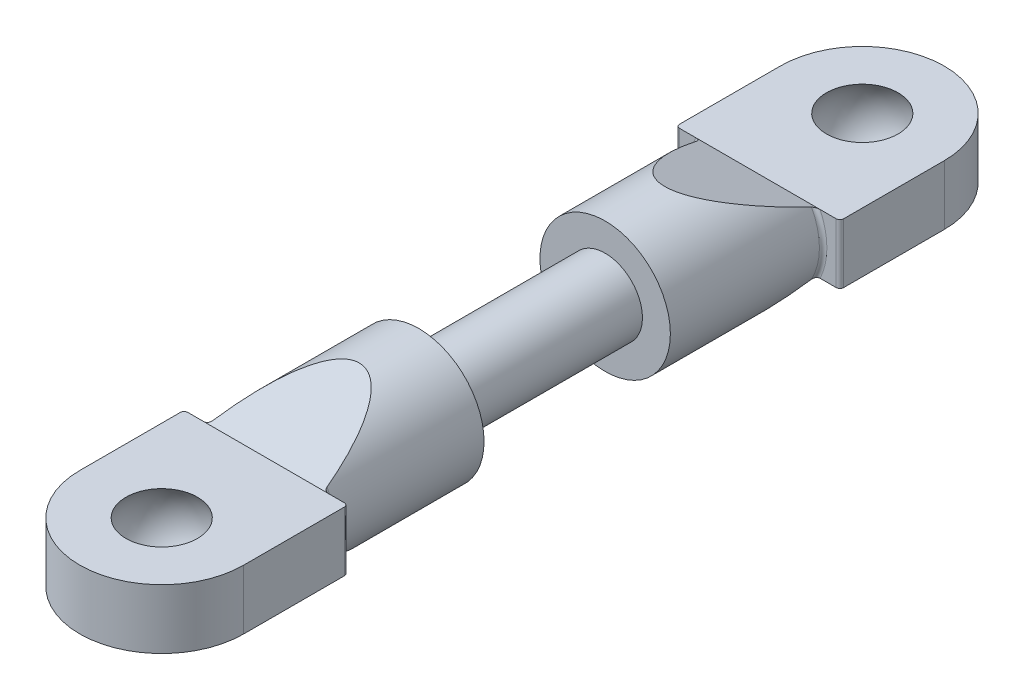
ISO-10303-21;
HEADER;
FILE_DESCRIPTION(('STEP AP214'),'2;1');
FILE_NAME('part.step','',(''),(''),'','','');
FILE_SCHEMA(('AUTOMOTIVE_DESIGN { 1 0 10303 214 1 1 1 1 }'));
ENDSEC;
DATA;
#1=APPLICATION_CONTEXT('core data for automotive mechanical design processes');
#2=APPLICATION_PROTOCOL_DEFINITION('international standard','automotive_design',2000,#1);
#3=PRODUCT_CONTEXT('',#1,'mechanical');
#4=PRODUCT('Part','Part','',(#3));
#5=PRODUCT_RELATED_PRODUCT_CATEGORY('part','',(#4));
#6=PRODUCT_DEFINITION_FORMATION('','',#4);
#7=PRODUCT_DEFINITION_CONTEXT('part definition',#1,'design');
#8=PRODUCT_DEFINITION('design','',#6,#7);
#9=PRODUCT_DEFINITION_SHAPE('','',#8);
#10=(LENGTH_UNIT() NAMED_UNIT(*) SI_UNIT(.MILLI.,.METRE.));
#11=(NAMED_UNIT(*) PLANE_ANGLE_UNIT() SI_UNIT($,.RADIAN.));
#12=(NAMED_UNIT(*) SI_UNIT($,.STERADIAN.) SOLID_ANGLE_UNIT());
#13=UNCERTAINTY_MEASURE_WITH_UNIT(LENGTH_MEASURE(1.E-05),#10,'distance_accuracy_value','');
#14=(GEOMETRIC_REPRESENTATION_CONTEXT(3) GLOBAL_UNCERTAINTY_ASSIGNED_CONTEXT((#13)) GLOBAL_UNIT_ASSIGNED_CONTEXT((#10,
#11,#12)) REPRESENTATION_CONTEXT('',''));
#15=CARTESIAN_POINT('',(0.,0.,0.));
#16=DIRECTION('',(0.,0.,1.));
#17=DIRECTION('',(1.,0.,0.));
#18=AXIS2_PLACEMENT_3D('',#15,#16,#17);
#19=CARTESIAN_POINT('',(0.,0.,-13.2));
#20=DIRECTION('',(0.,0.,1.));
#21=DIRECTION('',(1.,0.,0.));
#22=AXIS2_PLACEMENT_3D('',#19,#20,#21);
#23=CYLINDRICAL_SURFACE('',#22,3.5);
#24=CARTESIAN_POINT('',(0.,0.,-5.));
#25=DIRECTION('',(0.,0.,1.));
#26=DIRECTION('',(1.,0.,0.));
#27=AXIS2_PLACEMENT_3D('',#24,#25,#26);
#28=CIRCLE('',#27,3.5);
#29=CARTESIAN_POINT('',(3.5,0.,-5.));
#30=VERTEX_POINT('',#29);
#31=EDGE_CURVE('E184',#30,#30,#28,.T.);
#32=ORIENTED_EDGE('',*,*,#31,.F.);
#33=EDGE_LOOP('',(#32));
#34=FACE_BOUND('',#33,.T.);
#35=CARTESIAN_POINT('',(0.,0.,-17.4105263157895));
#36=DIRECTION('',(0.,0.934783580588349,-0.355217760623573));
#37=DIRECTION('',(0.,0.355217760623573,0.934783580588349));
#38=AXIS2_PLACEMENT_3D('',#35,#36,#37);
#39=ELLIPSE('',#38,9.8531109307594,3.5);
#40=CARTESIAN_POINT('',(3.07262493643464,1.676,-13.));
#41=VERTEX_POINT('',#40);
#42=CARTESIAN_POINT('',(-3.07262493643464,1.676,-13.));
#43=VERTEX_POINT('',#42);
#44=EDGE_CURVE('E517',#41,#43,#39,.F.);
#45=ORIENTED_EDGE('',*,*,#44,.T.);
#46=CARTESIAN_POINT('',(0.,0.,-13.));
#47=DIRECTION('',(0.,0.,1.));
#48=DIRECTION('',(1.,0.,0.));
#49=AXIS2_PLACEMENT_3D('',#46,#47,#48);
#50=CIRCLE('',#49,3.5);
#51=CARTESIAN_POINT('',(-3.07262493643464,-1.676,-13.));
#52=VERTEX_POINT('',#51);
#53=EDGE_CURVE('E369',#43,#52,#50,.T.);
#54=ORIENTED_EDGE('',*,*,#53,.T.);
#55=CARTESIAN_POINT('',(0.,0.,-17.4105263157895));
#56=DIRECTION('',(0.,-0.934783580588349,-0.355217760623573));
#57=DIRECTION('',(0.,-0.355217760623573,0.934783580588349));
#58=AXIS2_PLACEMENT_3D('',#55,#56,#57);
#59=ELLIPSE('',#58,9.8531109307594,3.5);
#60=CARTESIAN_POINT('',(3.07262493643464,-1.676,-13.));
#61=VERTEX_POINT('',#60);
#62=EDGE_CURVE('E208',#52,#61,#59,.F.);
#63=ORIENTED_EDGE('',*,*,#62,.T.);
#64=CARTESIAN_POINT('',(0.,0.,-13.));
#65=DIRECTION('',(0.,0.,1.));
#66=DIRECTION('',(1.,0.,0.));
#67=AXIS2_PLACEMENT_3D('',#64,#65,#66);
#68=CIRCLE('',#67,3.5);
#69=EDGE_CURVE('E366',#61,#41,#68,.T.);
#70=ORIENTED_EDGE('',*,*,#69,.T.);
#71=EDGE_LOOP('',(#45,#54,#63,#70));
#72=FACE_BOUND('',#71,.T.);
#73=ADVANCED_FACE('F34',(#34,#72),#23,.T.);
#74=CARTESIAN_POINT('',(0.,0.,5.));
#75=DIRECTION('',(0.,0.,-1.));
#76=DIRECTION('',(-1.,0.,0.));
#77=AXIS2_PLACEMENT_3D('',#74,#75,#76);
#78=CYLINDRICAL_SURFACE('',#77,2.);
#79=CARTESIAN_POINT('',(0.,0.,5.));
#80=DIRECTION('',(0.,0.,1.));
#81=DIRECTION('',(1.,0.,0.));
#82=AXIS2_PLACEMENT_3D('',#79,#80,#81);
#83=CIRCLE('',#82,2.);
#84=CARTESIAN_POINT('',(2.,0.,5.));
#85=VERTEX_POINT('',#84);
#86=EDGE_CURVE('E267',#85,#85,#83,.T.);
#87=ORIENTED_EDGE('',*,*,#86,.F.);
#88=EDGE_LOOP('',(#87));
#89=FACE_BOUND('',#88,.T.);
#90=CARTESIAN_POINT('',(0.,0.,-5.));
#91=DIRECTION('',(0.,0.,-1.));
#92=DIRECTION('',(-1.,0.,0.));
#93=AXIS2_PLACEMENT_3D('',#90,#91,#92);
#94=CIRCLE('',#93,2.);
#95=CARTESIAN_POINT('',(-2.,0.,-5.));
#96=VERTEX_POINT('',#95);
#97=EDGE_CURVE('E219',#96,#96,#94,.T.);
#98=ORIENTED_EDGE('',*,*,#97,.F.);
#99=EDGE_LOOP('',(#98));
#100=FACE_BOUND('',#99,.T.);
#101=ADVANCED_FACE('F429',(#89,#100),#78,.T.);
#102=CARTESIAN_POINT('',(0.,0.,13.2));
#103=DIRECTION('',(0.,0.,-1.));
#104=DIRECTION('',(-1.,0.,0.));
#105=AXIS2_PLACEMENT_3D('',#102,#103,#104);
#106=CYLINDRICAL_SURFACE('',#105,3.5);
#107=CARTESIAN_POINT('',(0.,0.,17.4105263157895));
#108=DIRECTION('',(0.,0.934783580588349,-0.355217760623573));
#109=DIRECTION('',(0.,-0.355217760623573,-0.934783580588349));
#110=AXIS2_PLACEMENT_3D('',#107,#108,#109);
#111=ELLIPSE('',#110,9.8531109307594,3.5);
#112=CARTESIAN_POINT('',(3.07262493643464,-1.676,13.));
#113=VERTEX_POINT('',#112);
#114=CARTESIAN_POINT('',(-3.07262493643464,-1.676,13.));
#115=VERTEX_POINT('',#114);
#116=EDGE_CURVE('E231',#113,#115,#111,.T.);
#117=ORIENTED_EDGE('',*,*,#116,.T.);
#118=CARTESIAN_POINT('',(0.,0.,13.));
#119=DIRECTION('',(0.,0.,1.));
#120=DIRECTION('',(1.,0.,0.));
#121=AXIS2_PLACEMENT_3D('',#118,#119,#120);
#122=CIRCLE('',#121,3.5);
#123=CARTESIAN_POINT('',(-3.07262493643464,1.676,13.));
#124=VERTEX_POINT('',#123);
#125=EDGE_CURVE('E288',#115,#124,#122,.F.);
#126=ORIENTED_EDGE('',*,*,#125,.T.);
#127=CARTESIAN_POINT('',(0.,0.,17.4105263157895));
#128=DIRECTION('',(0.,-0.934783580588349,-0.355217760623573));
#129=DIRECTION('',(0.,0.355217760623573,-0.934783580588349));
#130=AXIS2_PLACEMENT_3D('',#127,#128,#129);
#131=ELLIPSE('',#130,9.8531109307594,3.5);
#132=CARTESIAN_POINT('',(3.07262493643464,1.676,13.));
#133=VERTEX_POINT('',#132);
#134=EDGE_CURVE('E228',#124,#133,#131,.T.);
#135=ORIENTED_EDGE('',*,*,#134,.T.);
#136=CARTESIAN_POINT('',(0.,0.,13.));
#137=DIRECTION('',(0.,0.,1.));
#138=DIRECTION('',(1.,0.,0.));
#139=AXIS2_PLACEMENT_3D('',#136,#137,#138);
#140=CIRCLE('',#139,3.5);
#141=EDGE_CURVE('E286',#133,#113,#140,.F.);
#142=ORIENTED_EDGE('',*,*,#141,.T.);
#143=EDGE_LOOP('',(#117,#126,#135,#142));
#144=FACE_BOUND('',#143,.T.);
#145=CARTESIAN_POINT('',(0.,0.,5.));
#146=DIRECTION('',(0.,0.,1.));
#147=DIRECTION('',(1.,0.,0.));
#148=AXIS2_PLACEMENT_3D('',#145,#146,#147);
#149=CIRCLE('',#148,3.5);
#150=CARTESIAN_POINT('',(3.5,0.,5.));
#151=VERTEX_POINT('',#150);
#152=EDGE_CURVE('E264',#151,#151,#149,.T.);
#153=ORIENTED_EDGE('',*,*,#152,.T.);
#154=EDGE_LOOP('',(#153));
#155=FACE_BOUND('',#154,.T.);
#156=ADVANCED_FACE('F490',(#144,#155),#106,.T.);
#157=CARTESIAN_POINT('',(0.,0.,5.));
#158=DIRECTION('',(0.,0.,1.));
#159=DIRECTION('',(1.,0.,0.));
#160=AXIS2_PLACEMENT_3D('',#157,#158,#159);
#161=PLANE('',#160);
#162=ORIENTED_EDGE('',*,*,#86,.T.);
#163=EDGE_LOOP('',(#162));
#164=FACE_BOUND('',#163,.T.);
#165=ORIENTED_EDGE('',*,*,#152,.F.);
#166=EDGE_LOOP('',(#165));
#167=FACE_BOUND('',#166,.T.);
#168=ADVANCED_FACE('F493',(#164,#167),#161,.F.);
#169=CARTESIAN_POINT('',(4.4,1.6,13.2));
#170=DIRECTION('',(0.,0.,1.));
#171=DIRECTION('',(1.,0.,0.));
#172=AXIS2_PLACEMENT_3D('',#169,#170,#171);
#173=PLANE('',#172);
#174=DIRECTION('',(-1.,0.,0.));
#175=VECTOR('',#174,1.);
#176=CARTESIAN_POINT('',(4.4,-1.6,13.2));
#177=LINE('',#176,#175);
#178=CARTESIAN_POINT('',(-3.33616546352245,-1.6,13.2));
#179=VERTEX_POINT('',#178);
#180=CARTESIAN_POINT('',(-4.2,-1.6,13.2));
#181=VERTEX_POINT('',#180);
#182=EDGE_CURVE('E251',#179,#181,#177,.T.);
#183=ORIENTED_EDGE('',*,*,#182,.T.);
#184=DIRECTION('',(0.,-1.,0.));
#185=VECTOR('',#184,1.);
#186=CARTESIAN_POINT('',(-4.2,1.6,13.2));
#187=LINE('',#186,#185);
#188=CARTESIAN_POINT('',(-4.2,1.6,13.2));
#189=VERTEX_POINT('',#188);
#190=EDGE_CURVE('E280',#181,#189,#187,.F.);
#191=ORIENTED_EDGE('',*,*,#190,.T.);
#192=DIRECTION('',(-1.,0.,0.));
#193=VECTOR('',#192,1.);
#194=CARTESIAN_POINT('',(4.4,1.6,13.2));
#195=LINE('',#194,#193);
#196=CARTESIAN_POINT('',(-3.33616546352245,1.6,13.2));
#197=VERTEX_POINT('',#196);
#198=EDGE_CURVE('E238',#197,#189,#195,.T.);
#199=ORIENTED_EDGE('',*,*,#198,.F.);
#200=CARTESIAN_POINT('',(0.,0.,13.2));
#201=DIRECTION('',(0.,0.,1.));
#202=DIRECTION('',(1.,0.,0.));
#203=AXIS2_PLACEMENT_3D('',#200,#201,#202);
#204=CIRCLE('',#203,3.7);
#205=EDGE_CURVE('E277',#197,#179,#204,.T.);
#206=ORIENTED_EDGE('',*,*,#205,.T.);
#207=EDGE_LOOP('',(#183,#191,#199,#206));
#208=FACE_BOUND('',#207,.T.);
#209=ADVANCED_FACE('F458',(#208),#173,.F.);
#210=CARTESIAN_POINT('',(4.2,1.6,13.2));
#211=VERTEX_POINT('',#210);
#212=CARTESIAN_POINT('',(3.33616546352246,1.6,13.2));
#213=VERTEX_POINT('',#212);
#214=EDGE_CURVE('E240',#211,#213,#195,.T.);
#215=ORIENTED_EDGE('',*,*,#214,.F.);
#216=DIRECTION('',(0.,-1.,0.));
#217=VECTOR('',#216,1.);
#218=CARTESIAN_POINT('',(4.2,1.6,13.2));
#219=LINE('',#218,#217);
#220=CARTESIAN_POINT('',(4.2,-1.6,13.2));
#221=VERTEX_POINT('',#220);
#222=EDGE_CURVE('E293',#211,#221,#219,.T.);
#223=ORIENTED_EDGE('',*,*,#222,.T.);
#224=CARTESIAN_POINT('',(3.33616546352246,-1.6,13.2));
#225=VERTEX_POINT('',#224);
#226=EDGE_CURVE('E252',#221,#225,#177,.T.);
#227=ORIENTED_EDGE('',*,*,#226,.T.);
#228=CARTESIAN_POINT('',(0.,0.,13.2));
#229=DIRECTION('',(0.,0.,1.));
#230=DIRECTION('',(1.,0.,0.));
#231=AXIS2_PLACEMENT_3D('',#228,#229,#230);
#232=CIRCLE('',#231,3.7);
#233=EDGE_CURVE('E290',#225,#213,#232,.T.);
#234=ORIENTED_EDGE('',*,*,#233,.T.);
#235=EDGE_LOOP('',(#215,#223,#227,#234));
#236=FACE_BOUND('',#235,.T.);
#237=ADVANCED_FACE('F486',(#236),#173,.F.);
#238=CARTESIAN_POINT('',(4.4,1.6,13.2));
#239=DIRECTION('',(-1.,0.,0.));
#240=DIRECTION('',(0.,0.,1.));
#241=AXIS2_PLACEMENT_3D('',#238,#239,#240);
#242=PLANE('',#241);
#243=DIRECTION('',(0.,0.,-1.));
#244=VECTOR('',#243,1.);
#245=CARTESIAN_POINT('',(4.4,-1.6,13.2));
#246=LINE('',#245,#244);
#247=CARTESIAN_POINT('',(4.4,-1.6,18.8));
#248=VERTEX_POINT('',#247);
#249=CARTESIAN_POINT('',(4.4,-1.6,13.4));
#250=VERTEX_POINT('',#249);
#251=EDGE_CURVE('E234',#248,#250,#246,.T.);
#252=ORIENTED_EDGE('',*,*,#251,.T.);
#253=DIRECTION('',(0.,-1.,0.));
#254=VECTOR('',#253,1.);
#255=CARTESIAN_POINT('',(4.4,1.6,13.4));
#256=LINE('',#255,#254);
#257=CARTESIAN_POINT('',(4.4,1.6,13.4));
#258=VERTEX_POINT('',#257);
#259=EDGE_CURVE('E296',#250,#258,#256,.F.);
#260=ORIENTED_EDGE('',*,*,#259,.T.);
#261=DIRECTION('',(0.,0.,-1.));
#262=VECTOR('',#261,1.);
#263=CARTESIAN_POINT('',(4.4,1.6,13.2));
#264=LINE('',#263,#262);
#265=CARTESIAN_POINT('',(4.4,1.6,18.8));
#266=VERTEX_POINT('',#265);
#267=EDGE_CURVE('E235',#266,#258,#264,.T.);
#268=ORIENTED_EDGE('',*,*,#267,.F.);
#269=DIRECTION('',(0.,-1.,0.));
#270=VECTOR('',#269,1.);
#271=CARTESIAN_POINT('',(4.4,1.6,18.8));
#272=LINE('',#271,#270);
#273=EDGE_CURVE('E248',#266,#248,#272,.T.);
#274=ORIENTED_EDGE('',*,*,#273,.T.);
#275=EDGE_LOOP('',(#252,#260,#268,#274));
#276=FACE_BOUND('',#275,.T.);
#277=ADVANCED_FACE('F480',(#276),#242,.F.);
#278=CARTESIAN_POINT('',(-4.4,1.6,13.2));
#279=DIRECTION('',(1.,0.,0.));
#280=DIRECTION('',(0.,0.,-1.));
#281=AXIS2_PLACEMENT_3D('',#278,#279,#280);
#282=PLANE('',#281);
#283=DIRECTION('',(0.,0.,1.));
#284=VECTOR('',#283,1.);
#285=CARTESIAN_POINT('',(-4.4,1.6,13.2));
#286=LINE('',#285,#284);
#287=CARTESIAN_POINT('',(-4.4,1.6,13.4));
#288=VERTEX_POINT('',#287);
#289=CARTESIAN_POINT('',(-4.4,1.6,18.8));
#290=VERTEX_POINT('',#289);
#291=EDGE_CURVE('E243',#288,#290,#286,.T.);
#292=ORIENTED_EDGE('',*,*,#291,.F.);
#293=DIRECTION('',(0.,-1.,0.));
#294=VECTOR('',#293,1.);
#295=CARTESIAN_POINT('',(-4.4,1.6,13.4));
#296=LINE('',#295,#294);
#297=CARTESIAN_POINT('',(-4.4,-1.6,13.4));
#298=VERTEX_POINT('',#297);
#299=EDGE_CURVE('E270',#288,#298,#296,.T.);
#300=ORIENTED_EDGE('',*,*,#299,.T.);
#301=DIRECTION('',(0.,0.,1.));
#302=VECTOR('',#301,1.);
#303=CARTESIAN_POINT('',(-4.4,-1.6,13.2));
#304=LINE('',#303,#302);
#305=CARTESIAN_POINT('',(-4.4,-1.6,18.8));
#306=VERTEX_POINT('',#305);
#307=EDGE_CURVE('E255',#298,#306,#304,.T.);
#308=ORIENTED_EDGE('',*,*,#307,.T.);
#309=DIRECTION('',(0.,-1.,0.));
#310=VECTOR('',#309,1.);
#311=CARTESIAN_POINT('',(-4.4,1.6,18.8));
#312=LINE('',#311,#310);
#313=EDGE_CURVE('E261',#290,#306,#312,.T.);
#314=ORIENTED_EDGE('',*,*,#313,.F.);
#315=EDGE_LOOP('',(#292,#300,#308,#314));
#316=FACE_BOUND('',#315,.T.);
#317=ADVANCED_FACE('F470',(#316),#282,.F.);
#318=CARTESIAN_POINT('',(0.,1.6,18.8));
#319=DIRECTION('',(0.,-1.,0.));
#320=DIRECTION('',(0.,0.,-1.));
#321=AXIS2_PLACEMENT_3D('',#318,#319,#320);
#322=CYLINDRICAL_SURFACE('',#321,4.4);
#323=CARTESIAN_POINT('',(0.,-1.6,18.8));
#324=DIRECTION('',(0.,1.,0.));
#325=DIRECTION('',(0.,0.,1.));
#326=AXIS2_PLACEMENT_3D('',#323,#324,#325);
#327=CIRCLE('',#326,4.4);
#328=EDGE_CURVE('E239',#306,#248,#327,.T.);
#329=ORIENTED_EDGE('',*,*,#328,.T.);
#330=ORIENTED_EDGE('',*,*,#273,.F.);
#331=CARTESIAN_POINT('',(0.,1.6,18.8));
#332=DIRECTION('',(0.,1.,0.));
#333=DIRECTION('',(0.,0.,1.));
#334=AXIS2_PLACEMENT_3D('',#331,#332,#333);
#335=CIRCLE('',#334,4.4);
#336=EDGE_CURVE('E246',#290,#266,#335,.T.);
#337=ORIENTED_EDGE('',*,*,#336,.F.);
#338=ORIENTED_EDGE('',*,*,#313,.T.);
#339=EDGE_LOOP('',(#329,#330,#337,#338));
#340=FACE_BOUND('',#339,.T.);
#341=ADVANCED_FACE('F476',(#340),#322,.T.);
#342=CARTESIAN_POINT('',(0.,1.6,18.8));
#343=DIRECTION('',(0.,1.,0.));
#344=DIRECTION('',(0.,0.,1.));
#345=AXIS2_PLACEMENT_3D('',#342,#343,#344);
#346=PLANE('',#345);
#347=CARTESIAN_POINT('',(0.,1.6,18.8));
#348=DIRECTION('',(0.,-1.,0.));
#349=DIRECTION('',(0.,0.,-1.));
#350=AXIS2_PLACEMENT_3D('',#347,#348,#349);
#351=CIRCLE('',#350,1.92093727122986);
#352=CARTESIAN_POINT('',(0.,1.6,16.8790627287701));
#353=VERTEX_POINT('',#352);
#354=EDGE_CURVE('E225',#353,#353,#351,.T.);
#355=ORIENTED_EDGE('',*,*,#354,.T.);
#356=EDGE_LOOP('',(#355));
#357=FACE_BOUND('',#356,.T.);
#358=ORIENTED_EDGE('',*,*,#198,.T.);
#359=CARTESIAN_POINT('',(-4.2,1.6,13.4));
#360=DIRECTION('',(0.,1.,0.));
#361=DIRECTION('',(0.,0.,1.));
#362=AXIS2_PLACEMENT_3D('',#359,#360,#361);
#363=CIRCLE('',#362,0.2);
#364=EDGE_CURVE('E284',#189,#288,#363,.T.);
#365=ORIENTED_EDGE('',*,*,#364,.T.);
#366=ORIENTED_EDGE('',*,*,#291,.T.);
#367=ORIENTED_EDGE('',*,*,#336,.T.);
#368=ORIENTED_EDGE('',*,*,#267,.T.);
#369=CARTESIAN_POINT('',(4.2,1.6,13.4));
#370=DIRECTION('',(0.,1.,0.));
#371=DIRECTION('',(0.,0.,1.));
#372=AXIS2_PLACEMENT_3D('',#369,#370,#371);
#373=CIRCLE('',#372,0.2);
#374=EDGE_CURVE('E282',#258,#211,#373,.T.);
#375=ORIENTED_EDGE('',*,*,#374,.T.);
#376=ORIENTED_EDGE('',*,*,#214,.T.);
#377=EDGE_CURVE('E244',#213,#197,#195,.T.);
#378=ORIENTED_EDGE('',*,*,#377,.T.);
#379=EDGE_LOOP('',(#358,#365,#366,#367,#368,#375,#376,#378));
#380=FACE_BOUND('',#379,.T.);
#381=ADVANCED_FACE('F466',(#357,#380),#346,.T.);
#382=CARTESIAN_POINT('',(0.,-1.6,18.8));
#383=DIRECTION('',(0.,1.,0.));
#384=DIRECTION('',(0.,0.,1.));
#385=AXIS2_PLACEMENT_3D('',#382,#383,#384);
#386=PLANE('',#385);
#387=CARTESIAN_POINT('',(0.,-1.6,18.8));
#388=DIRECTION('',(0.,-1.,0.));
#389=DIRECTION('',(0.,0.,-1.));
#390=AXIS2_PLACEMENT_3D('',#387,#388,#389);
#391=CIRCLE('',#390,1.92093727122986);
#392=CARTESIAN_POINT('',(0.,-1.6,16.8790627287701));
#393=VERTEX_POINT('',#392);
#394=EDGE_CURVE('E222',#393,#393,#391,.T.);
#395=ORIENTED_EDGE('',*,*,#394,.F.);
#396=EDGE_LOOP('',(#395));
#397=FACE_BOUND('',#396,.T.);
#398=ORIENTED_EDGE('',*,*,#307,.F.);
#399=CARTESIAN_POINT('',(-4.2,-1.6,13.4));
#400=DIRECTION('',(0.,1.,0.));
#401=DIRECTION('',(0.,0.,1.));
#402=AXIS2_PLACEMENT_3D('',#399,#400,#401);
#403=CIRCLE('',#402,0.2);
#404=EDGE_CURVE('E275',#298,#181,#403,.F.);
#405=ORIENTED_EDGE('',*,*,#404,.T.);
#406=ORIENTED_EDGE('',*,*,#182,.F.);
#407=EDGE_CURVE('E256',#225,#179,#177,.T.);
#408=ORIENTED_EDGE('',*,*,#407,.F.);
#409=ORIENTED_EDGE('',*,*,#226,.F.);
#410=CARTESIAN_POINT('',(4.2,-1.6,13.4));
#411=DIRECTION('',(0.,1.,0.));
#412=DIRECTION('',(0.,0.,1.));
#413=AXIS2_PLACEMENT_3D('',#410,#411,#412);
#414=CIRCLE('',#413,0.2);
#415=EDGE_CURVE('E273',#221,#250,#414,.F.);
#416=ORIENTED_EDGE('',*,*,#415,.T.);
#417=ORIENTED_EDGE('',*,*,#251,.F.);
#418=ORIENTED_EDGE('',*,*,#328,.F.);
#419=EDGE_LOOP('',(#398,#405,#406,#408,#409,#416,#417,#418));
#420=FACE_BOUND('',#419,.T.);
#421=ADVANCED_FACE('F443',(#397,#420),#386,.F.);
#422=CARTESIAN_POINT('',(-4.4,-3.5,8.2));
#423=DIRECTION('',(0.,0.934783580588349,-0.355217760623573));
#424=DIRECTION('',(0.,0.355217760623573,0.934783580588349));
#425=AXIS2_PLACEMENT_3D('',#422,#423,#424);
#426=PLANE('',#425);
#427=ORIENTED_EDGE('',*,*,#116,.F.);
#428=CARTESIAN_POINT('',(3.07262493643464,-1.676,13.));
#429=CARTESIAN_POINT('',(3.07525913325466,-1.67118005301752,13.0126840710065));
#430=CARTESIAN_POINT('',(3.07918235613,-1.66646683438346,13.0250872779383));
#431=CARTESIAN_POINT('',(3.08921423767296,-1.65737029362562,13.0490255430905));
#432=CARTESIAN_POINT('',(3.09531097073757,-1.65298532626488,13.0605649308819));
#433=CARTESIAN_POINT('',(3.10930483827098,-1.64462488245222,13.0825660988099));
#434=CARTESIAN_POINT('',(3.11719446836979,-1.64064779671413,13.0930321139102));
#435=CARTESIAN_POINT('',(3.13452107561461,-1.63313488010904,13.1128029470815));
#436=CARTESIAN_POINT('',(3.14396077179682,-1.62959984420624,13.1221056731415));
#437=CARTESIAN_POINT('',(3.1656427057623,-1.62254518390989,13.1406705686582));
#438=CARTESIAN_POINT('',(3.17809295409183,-1.6191059555853,13.1497211695124));
#439=CARTESIAN_POINT('',(3.20439258761493,-1.61298023516302,13.1658414864131));
#440=CARTESIAN_POINT('',(3.21824243400426,-1.61029399229686,13.1729105465872));
#441=CARTESIAN_POINT('',(3.24583713498838,-1.60596204525645,13.1843104072199));
#442=CARTESIAN_POINT('',(3.25949875334445,-1.60424943623041,13.1888172730779));
#443=CARTESIAN_POINT('',(3.28740504049291,-1.60164388059887,13.195673998424));
#444=CARTESIAN_POINT('',(3.30164782440968,-1.60074847488445,13.1980303292515));
#445=CARTESIAN_POINT('',(3.32270049692924,-1.60010487828012,13.199724004526));
#446=CARTESIAN_POINT('',(3.32943296953685,-1.59999977362747,13.2000005957172));
#447=CARTESIAN_POINT('',(3.33616546352246,-1.6,13.2));
#448=B_SPLINE_CURVE_WITH_KNOTS('',3,(#428,#429,#430,#431,#432,#433,#434,#435,#436,#437,#438,
#439,#440,#441,#442,#443,#444,#445,#446,#447),.UNSPECIFIED.,.F.,.F.,(4,2,2,2,2,2,2,2,2,4),(0.,
0.0413336866130559,0.0824439885943209,0.123385288722125,0.164399188315624,0.211509499743315,
0.258635385904519,0.301924917111099,0.345083748803917,0.365278356525198),.UNSPECIFIED.);
#449=EDGE_CURVE('E344',#113,#225,#448,.T.);
#450=ORIENTED_EDGE('',*,*,#449,.T.);
#451=ORIENTED_EDGE('',*,*,#407,.T.);
#452=CARTESIAN_POINT('',(-3.33616546352245,-1.6,13.2));
#453=CARTESIAN_POINT('',(-3.3217247889496,-1.60000102109849,13.1999973128987));
#454=CARTESIAN_POINT('',(-3.30732735398017,-1.60048239320306,13.1987305442025));
#455=CARTESIAN_POINT('',(-3.27903797361021,-1.60230122827091,13.1939441361292));
#456=CARTESIAN_POINT('',(-3.26514380820992,-1.6036342730108,13.1904361236558));
#457=CARTESIAN_POINT('',(-3.23816996533018,-1.60704814089075,13.1814522608138));
#458=CARTESIAN_POINT('',(-3.22508769183339,-1.60912641944026,13.1759831067361));
#459=CARTESIAN_POINT('',(-3.19990983462446,-1.61395329716965,13.163280796922));
#460=CARTESIAN_POINT('',(-3.18781652178628,-1.61670338430758,13.1560437255064));
#461=CARTESIAN_POINT('',(-3.1634801664601,-1.62317435200966,13.1390148631325));
#462=CARTESIAN_POINT('',(-3.15139976184893,-1.62697283382959,13.1290188583432));
#463=CARTESIAN_POINT('',(-3.12920292694255,-1.63522205983803,13.1073103688473));
#464=CARTESIAN_POINT('',(-3.11908278851064,-1.63967154399486,13.0956012000135));
#465=CARTESIAN_POINT('',(-3.10114453718378,-1.64916662645593,13.0706141409055));
#466=CARTESIAN_POINT('',(-3.09333905758674,-1.65421529294039,13.0573281764727));
#467=CARTESIAN_POINT('',(-3.08062512043024,-1.66478918173404,13.0295021533315));
#468=CARTESIAN_POINT('',(-3.07573640403396,-1.67031736770694,13.0149542955081));
#469=CARTESIAN_POINT('',(-3.07262493643464,-1.676,13.));
#470=B_SPLINE_CURVE_WITH_KNOTS('',3,(#452,#453,#454,#455,#456,#457,#458,#459,#460,#461,#462,
#463,#464,#465,#466,#467,#468,#469),.UNSPECIFIED.,.F.,.F.,(4,2,2,2,2,2,2,2,4),(0.,
0.0431979532669083,0.086173608238872,0.129003899288783,0.171929927242597,0.220106826716467,
0.268191682782834,0.316534347355092,0.365200597381242),.UNSPECIFIED.);
#471=EDGE_CURVE('E298',#179,#115,#470,.T.);
#472=ORIENTED_EDGE('',*,*,#471,.T.);
#473=EDGE_LOOP('',(#427,#450,#451,#472));
#474=FACE_BOUND('',#473,.T.);
#475=ADVANCED_FACE('F313',(#474),#426,.F.);
#476=CARTESIAN_POINT('',(-4.4,3.5,8.2));
#477=DIRECTION('',(0.,-0.934783580588349,-0.355217760623573));
#478=DIRECTION('',(0.,0.355217760623573,-0.934783580588349));
#479=AXIS2_PLACEMENT_3D('',#476,#477,#478);
#480=PLANE('',#479);
#481=ORIENTED_EDGE('',*,*,#134,.F.);
#482=CARTESIAN_POINT('',(-3.07262493643464,1.676,13.));
#483=CARTESIAN_POINT('',(-3.07525913325466,1.67118005301752,13.0126840710065));
#484=CARTESIAN_POINT('',(-3.07918235613,1.66646683438346,13.0250872779383));
#485=CARTESIAN_POINT('',(-3.08921423767296,1.65737029362562,13.0490255430905));
#486=CARTESIAN_POINT('',(-3.09531097073757,1.65298532626488,13.0605649308819));
#487=CARTESIAN_POINT('',(-3.10930483827098,1.64462488245222,13.0825660988099));
#488=CARTESIAN_POINT('',(-3.11719446836979,1.64064779671413,13.0930321139102));
#489=CARTESIAN_POINT('',(-3.13452107561461,1.63313488010904,13.1128029470815));
#490=CARTESIAN_POINT('',(-3.14396077179682,1.62959984420624,13.1221056731415));
#491=CARTESIAN_POINT('',(-3.1656427057623,1.62254518390989,13.1406705686582));
#492=CARTESIAN_POINT('',(-3.17809295409183,1.6191059555853,13.1497211695124));
#493=CARTESIAN_POINT('',(-3.20439258761493,1.61298023516302,13.1658414864131));
#494=CARTESIAN_POINT('',(-3.21824243400426,1.61029399229686,13.1729105465872));
#495=CARTESIAN_POINT('',(-3.24583713498838,1.60596204525645,13.1843104072199));
#496=CARTESIAN_POINT('',(-3.25949875334445,1.60424943623041,13.1888172730779));
#497=CARTESIAN_POINT('',(-3.28740504049291,1.60164388059887,13.195673998424));
#498=CARTESIAN_POINT('',(-3.30164782440968,1.60074847488445,13.1980303292515));
#499=CARTESIAN_POINT('',(-3.32270049692924,1.60010487828012,13.199724004526));
#500=CARTESIAN_POINT('',(-3.32943296953685,1.59999977362747,13.2000005957172));
#501=CARTESIAN_POINT('',(-3.33616546352245,1.6,13.2));
#502=B_SPLINE_CURVE_WITH_KNOTS('',3,(#482,#483,#484,#485,#486,#487,#488,#489,#490,#491,#492,
#493,#494,#495,#496,#497,#498,#499,#500,#501),.UNSPECIFIED.,.F.,.F.,(4,2,2,2,2,2,2,2,2,4),(0.,
0.0413336866130559,0.0824439885943209,0.123385288722125,0.164399188315624,0.211509499743315,
0.258635385904519,0.301924917111099,0.345083748803917,0.365278356525198),.UNSPECIFIED.);
#503=EDGE_CURVE('E306',#124,#197,#502,.T.);
#504=ORIENTED_EDGE('',*,*,#503,.T.);
#505=ORIENTED_EDGE('',*,*,#377,.F.);
#506=CARTESIAN_POINT('',(3.33616546352246,1.6,13.2));
#507=CARTESIAN_POINT('',(3.3217247889496,1.60000102109849,13.1999973128987));
#508=CARTESIAN_POINT('',(3.30732735398017,1.60048239320306,13.1987305442025));
#509=CARTESIAN_POINT('',(3.27903797361021,1.60230122827091,13.1939441361292));
#510=CARTESIAN_POINT('',(3.26514380820992,1.6036342730108,13.1904361236558));
#511=CARTESIAN_POINT('',(3.23816996533018,1.60704814089075,13.1814522608138));
#512=CARTESIAN_POINT('',(3.22508769183339,1.60912641944026,13.1759831067361));
#513=CARTESIAN_POINT('',(3.19990983462446,1.61395329716965,13.163280796922));
#514=CARTESIAN_POINT('',(3.18781652178628,1.61670338430758,13.1560437255064));
#515=CARTESIAN_POINT('',(3.1634801664601,1.62317435200966,13.1390148631325));
#516=CARTESIAN_POINT('',(3.15139976184893,1.62697283382959,13.1290188583432));
#517=CARTESIAN_POINT('',(3.12920292694255,1.63522205983803,13.1073103688473));
#518=CARTESIAN_POINT('',(3.11908278851064,1.63967154399486,13.0956012000135));
#519=CARTESIAN_POINT('',(3.10114453718378,1.64916662645593,13.0706141409055));
#520=CARTESIAN_POINT('',(3.09333905758674,1.65421529294039,13.0573281764727));
#521=CARTESIAN_POINT('',(3.08062512043024,1.66478918173404,13.0295021533315));
#522=CARTESIAN_POINT('',(3.07573640403396,1.67031736770694,13.0149542955081));
#523=CARTESIAN_POINT('',(3.07262493643464,1.676,13.));
#524=B_SPLINE_CURVE_WITH_KNOTS('',3,(#506,#507,#508,#509,#510,#511,#512,#513,#514,#515,#516,
#517,#518,#519,#520,#521,#522,#523),.UNSPECIFIED.,.F.,.F.,(4,2,2,2,2,2,2,2,4),(0.,
0.0431979532669087,0.0861736082388724,0.129003899288783,0.171929927242598,0.220106826716468,
0.268191682782835,0.316534347355092,0.365200597381241),.UNSPECIFIED.);
#525=EDGE_CURVE('E338',#213,#133,#524,.T.);
#526=ORIENTED_EDGE('',*,*,#525,.T.);
#527=EDGE_LOOP('',(#481,#504,#505,#526));
#528=FACE_BOUND('',#527,.T.);
#529=ADVANCED_FACE('F433',(#528),#480,.F.);
#530=CARTESIAN_POINT('',(-4.2,1.6,13.4));
#531=DIRECTION('',(0.,-1.,0.));
#532=DIRECTION('',(0.,0.,-1.));
#533=AXIS2_PLACEMENT_3D('',#530,#531,#532);
#534=CYLINDRICAL_SURFACE('',#533,0.2);
#535=ORIENTED_EDGE('',*,*,#364,.F.);
#536=ORIENTED_EDGE('',*,*,#190,.F.);
#537=ORIENTED_EDGE('',*,*,#404,.F.);
#538=ORIENTED_EDGE('',*,*,#299,.F.);
#539=EDGE_LOOP('',(#535,#536,#537,#538));
#540=FACE_BOUND('',#539,.T.);
#541=ADVANCED_FACE('F322',(#540),#534,.T.);
#542=CARTESIAN_POINT('',(0.,0.,13.));
#543=DIRECTION('',(0.,0.,1.));
#544=DIRECTION('',(1.,0.,0.));
#545=AXIS2_PLACEMENT_3D('',#542,#543,#544);
#546=TOROIDAL_SURFACE('',#545,3.7,0.2);
#547=ORIENTED_EDGE('',*,*,#503,.F.);
#548=ORIENTED_EDGE('',*,*,#125,.F.);
#549=ORIENTED_EDGE('',*,*,#471,.F.);
#550=ORIENTED_EDGE('',*,*,#205,.F.);
#551=EDGE_LOOP('',(#547,#548,#549,#550));
#552=FACE_BOUND('',#551,.T.);
#553=ADVANCED_FACE('F316',(#552),#546,.F.);
#554=CARTESIAN_POINT('',(4.2,1.6,13.4));
#555=DIRECTION('',(0.,-1.,0.));
#556=DIRECTION('',(0.,0.,-1.));
#557=AXIS2_PLACEMENT_3D('',#554,#555,#556);
#558=CYLINDRICAL_SURFACE('',#557,0.2);
#559=ORIENTED_EDGE('',*,*,#374,.F.);
#560=ORIENTED_EDGE('',*,*,#259,.F.);
#561=ORIENTED_EDGE('',*,*,#415,.F.);
#562=ORIENTED_EDGE('',*,*,#222,.F.);
#563=EDGE_LOOP('',(#559,#560,#561,#562));
#564=FACE_BOUND('',#563,.T.);
#565=ADVANCED_FACE('F321',(#564),#558,.T.);
#566=CARTESIAN_POINT('',(0.,0.,13.));
#567=DIRECTION('',(0.,0.,1.));
#568=DIRECTION('',(1.,0.,0.));
#569=AXIS2_PLACEMENT_3D('',#566,#567,#568);
#570=TOROIDAL_SURFACE('',#569,3.7,0.2);
#571=ORIENTED_EDGE('',*,*,#449,.F.);
#572=ORIENTED_EDGE('',*,*,#141,.F.);
#573=ORIENTED_EDGE('',*,*,#525,.F.);
#574=ORIENTED_EDGE('',*,*,#233,.F.);
#575=EDGE_LOOP('',(#571,#572,#573,#574));
#576=FACE_BOUND('',#575,.T.);
#577=ADVANCED_FACE('F328',(#576),#570,.F.);
#578=CARTESIAN_POINT('',(0.,0.,18.8));
#579=DIRECTION('',(0.,-1.,0.));
#580=DIRECTION('',(0.,0.,1.));
#581=AXIS2_PLACEMENT_3D('',#578,#579,#580);
#582=SPHERICAL_SURFACE('',#581,2.5);
#583=ORIENTED_EDGE('',*,*,#394,.T.);
#584=EDGE_LOOP('',(#583));
#585=FACE_BOUND('',#584,.T.);
#586=ORIENTED_EDGE('',*,*,#354,.F.);
#587=EDGE_LOOP('',(#586));
#588=FACE_BOUND('',#587,.T.);
#589=ADVANCED_FACE('F333',(#585,#588),#582,.F.);
#590=CARTESIAN_POINT('',(0.,0.,-5.));
#591=DIRECTION('',(0.,0.,-1.));
#592=DIRECTION('',(1.,0.,0.));
#593=AXIS2_PLACEMENT_3D('',#590,#591,#592);
#594=PLANE('',#593);
#595=ORIENTED_EDGE('',*,*,#97,.T.);
#596=EDGE_LOOP('',(#595));
#597=FACE_BOUND('',#596,.T.);
#598=ORIENTED_EDGE('',*,*,#31,.T.);
#599=EDGE_LOOP('',(#598));
#600=FACE_BOUND('',#599,.T.);
#601=ADVANCED_FACE('F415',(#597,#600),#594,.F.);
#602=CARTESIAN_POINT('',(4.4,1.6,-13.2));
#603=DIRECTION('',(0.,0.,1.));
#604=DIRECTION('',(1.,0.,0.));
#605=AXIS2_PLACEMENT_3D('',#602,#603,#604);
#606=PLANE('',#605);
#607=DIRECTION('',(-1.,0.,0.));
#608=VECTOR('',#607,1.);
#609=CARTESIAN_POINT('',(4.4,1.6,-13.2));
#610=LINE('',#609,#608);
#611=CARTESIAN_POINT('',(-3.33616546352245,1.6,-13.2));
#612=VERTEX_POINT('',#611);
#613=CARTESIAN_POINT('',(-4.2,1.6,-13.2));
#614=VERTEX_POINT('',#613);
#615=EDGE_CURVE('E200',#612,#614,#610,.T.);
#616=ORIENTED_EDGE('',*,*,#615,.T.);
#617=DIRECTION('',(0.,-1.,0.));
#618=VECTOR('',#617,1.);
#619=CARTESIAN_POINT('',(-4.2,1.6,-13.2));
#620=LINE('',#619,#618);
#621=CARTESIAN_POINT('',(-4.2,-1.6,-13.2));
#622=VERTEX_POINT('',#621);
#623=EDGE_CURVE('E354',#614,#622,#620,.T.);
#624=ORIENTED_EDGE('',*,*,#623,.T.);
#625=DIRECTION('',(-1.,0.,0.));
#626=VECTOR('',#625,1.);
#627=CARTESIAN_POINT('',(4.4,-1.6,-13.2));
#628=LINE('',#627,#626);
#629=CARTESIAN_POINT('',(-3.33616546352245,-1.6,-13.2));
#630=VERTEX_POINT('',#629);
#631=EDGE_CURVE('E212',#630,#622,#628,.T.);
#632=ORIENTED_EDGE('',*,*,#631,.F.);
#633=CARTESIAN_POINT('',(0.,0.,-13.2));
#634=DIRECTION('',(0.,0.,1.));
#635=DIRECTION('',(1.,0.,0.));
#636=AXIS2_PLACEMENT_3D('',#633,#634,#635);
#637=CIRCLE('',#636,3.7);
#638=EDGE_CURVE('E351',#630,#612,#637,.F.);
#639=ORIENTED_EDGE('',*,*,#638,.T.);
#640=EDGE_LOOP('',(#616,#624,#632,#639));
#641=FACE_BOUND('',#640,.T.);
#642=ADVANCED_FACE('F411',(#641),#606,.T.);
#643=CARTESIAN_POINT('',(4.2,-1.6,-13.2));
#644=VERTEX_POINT('',#643);
#645=CARTESIAN_POINT('',(3.33616546352246,-1.6,-13.2));
#646=VERTEX_POINT('',#645);
#647=EDGE_CURVE('E193',#644,#646,#628,.T.);
#648=ORIENTED_EDGE('',*,*,#647,.F.);
#649=DIRECTION('',(0.,-1.,0.));
#650=VECTOR('',#649,1.);
#651=CARTESIAN_POINT('',(4.2,1.6,-13.2));
#652=LINE('',#651,#650);
#653=CARTESIAN_POINT('',(4.2,1.6,-13.2));
#654=VERTEX_POINT('',#653);
#655=EDGE_CURVE('E377',#644,#654,#652,.F.);
#656=ORIENTED_EDGE('',*,*,#655,.T.);
#657=CARTESIAN_POINT('',(3.33616546352246,1.6,-13.2));
#658=VERTEX_POINT('',#657);
#659=EDGE_CURVE('E204',#654,#658,#610,.T.);
#660=ORIENTED_EDGE('',*,*,#659,.T.);
#661=CARTESIAN_POINT('',(0.,0.,-13.2));
#662=DIRECTION('',(0.,0.,1.));
#663=DIRECTION('',(1.,0.,0.));
#664=AXIS2_PLACEMENT_3D('',#661,#662,#663);
#665=CIRCLE('',#664,3.7);
#666=EDGE_CURVE('E374',#658,#646,#665,.F.);
#667=ORIENTED_EDGE('',*,*,#666,.T.);
#668=EDGE_LOOP('',(#648,#656,#660,#667));
#669=FACE_BOUND('',#668,.T.);
#670=ADVANCED_FACE('F414',(#669),#606,.T.);
#671=CARTESIAN_POINT('',(4.4,1.6,-13.2));
#672=DIRECTION('',(1.,0.,0.));
#673=DIRECTION('',(0.,0.,-1.));
#674=AXIS2_PLACEMENT_3D('',#671,#672,#673);
#675=PLANE('',#674);
#676=DIRECTION('',(0.,0.,1.));
#677=VECTOR('',#676,1.);
#678=CARTESIAN_POINT('',(4.4,1.6,-13.2));
#679=LINE('',#678,#677);
#680=CARTESIAN_POINT('',(4.4,1.6,-18.8));
#681=VERTEX_POINT('',#680);
#682=CARTESIAN_POINT('',(4.4,1.6,-13.4));
#683=VERTEX_POINT('',#682);
#684=EDGE_CURVE('E176',#681,#683,#679,.T.);
#685=ORIENTED_EDGE('',*,*,#684,.T.);
#686=DIRECTION('',(0.,-1.,0.));
#687=VECTOR('',#686,1.);
#688=CARTESIAN_POINT('',(4.4,1.6,-13.4));
#689=LINE('',#688,#687);
#690=CARTESIAN_POINT('',(4.4,-1.6,-13.4));
#691=VERTEX_POINT('',#690);
#692=EDGE_CURVE('E372',#683,#691,#689,.T.);
#693=ORIENTED_EDGE('',*,*,#692,.T.);
#694=DIRECTION('',(0.,0.,1.));
#695=VECTOR('',#694,1.);
#696=CARTESIAN_POINT('',(4.4,-1.6,-13.2));
#697=LINE('',#696,#695);
#698=CARTESIAN_POINT('',(4.4,-1.6,-18.8));
#699=VERTEX_POINT('',#698);
#700=EDGE_CURVE('E179',#699,#691,#697,.T.);
#701=ORIENTED_EDGE('',*,*,#700,.F.);
#702=DIRECTION('',(0.,-1.,0.));
#703=VECTOR('',#702,1.);
#704=CARTESIAN_POINT('',(4.4,1.6,-18.8));
#705=LINE('',#704,#703);
#706=EDGE_CURVE('E172',#681,#699,#705,.T.);
#707=ORIENTED_EDGE('',*,*,#706,.F.);
#708=EDGE_LOOP('',(#685,#693,#701,#707));
#709=FACE_BOUND('',#708,.T.);
#710=ADVANCED_FACE('F174',(#709),#675,.T.);
#711=CARTESIAN_POINT('',(0.,1.6,-18.8));
#712=DIRECTION('',(0.,-1.,0.));
#713=DIRECTION('',(0.,0.,-1.));
#714=AXIS2_PLACEMENT_3D('',#711,#712,#713);
#715=CYLINDRICAL_SURFACE('',#714,4.4);
#716=CARTESIAN_POINT('',(0.,-1.6,-18.8));
#717=DIRECTION('',(0.,-1.,0.));
#718=DIRECTION('',(0.,0.,-1.));
#719=AXIS2_PLACEMENT_3D('',#716,#717,#718);
#720=CIRCLE('',#719,4.4);
#721=CARTESIAN_POINT('',(-4.4,-1.6,-18.8));
#722=VERTEX_POINT('',#721);
#723=EDGE_CURVE('E207',#722,#699,#720,.T.);
#724=ORIENTED_EDGE('',*,*,#723,.F.);
#725=DIRECTION('',(0.,-1.,0.));
#726=VECTOR('',#725,1.);
#727=CARTESIAN_POINT('',(-4.4,1.6,-18.8));
#728=LINE('',#727,#726);
#729=CARTESIAN_POINT('',(-4.4,1.6,-18.8));
#730=VERTEX_POINT('',#729);
#731=EDGE_CURVE('E185',#730,#722,#728,.T.);
#732=ORIENTED_EDGE('',*,*,#731,.F.);
#733=CARTESIAN_POINT('',(0.,1.6,-18.8));
#734=DIRECTION('',(0.,-1.,0.));
#735=DIRECTION('',(0.,0.,-1.));
#736=AXIS2_PLACEMENT_3D('',#733,#734,#735);
#737=CIRCLE('',#736,4.4);
#738=EDGE_CURVE('E190',#730,#681,#737,.T.);
#739=ORIENTED_EDGE('',*,*,#738,.T.);
#740=ORIENTED_EDGE('',*,*,#706,.T.);
#741=EDGE_LOOP('',(#724,#732,#739,#740));
#742=FACE_BOUND('',#741,.T.);
#743=ADVANCED_FACE('F196',(#742),#715,.T.);
#744=CARTESIAN_POINT('',(-4.4,1.6,-13.2));
#745=DIRECTION('',(-1.,0.,0.));
#746=DIRECTION('',(0.,0.,1.));
#747=AXIS2_PLACEMENT_3D('',#744,#745,#746);
#748=PLANE('',#747);
#749=DIRECTION('',(0.,0.,-1.));
#750=VECTOR('',#749,1.);
#751=CARTESIAN_POINT('',(-4.4,-1.6,-13.2));
#752=LINE('',#751,#750);
#753=CARTESIAN_POINT('',(-4.4,-1.6,-13.4));
#754=VERTEX_POINT('',#753);
#755=EDGE_CURVE('E210',#754,#722,#752,.T.);
#756=ORIENTED_EDGE('',*,*,#755,.F.);
#757=DIRECTION('',(0.,-1.,0.));
#758=VECTOR('',#757,1.);
#759=CARTESIAN_POINT('',(-4.4,1.6,-13.4));
#760=LINE('',#759,#758);
#761=CARTESIAN_POINT('',(-4.4,1.6,-13.4));
#762=VERTEX_POINT('',#761);
#763=EDGE_CURVE('E361',#754,#762,#760,.F.);
#764=ORIENTED_EDGE('',*,*,#763,.T.);
#765=DIRECTION('',(0.,0.,-1.));
#766=VECTOR('',#765,1.);
#767=CARTESIAN_POINT('',(-4.4,1.6,-13.2));
#768=LINE('',#767,#766);
#769=EDGE_CURVE('E198',#762,#730,#768,.T.);
#770=ORIENTED_EDGE('',*,*,#769,.T.);
#771=ORIENTED_EDGE('',*,*,#731,.T.);
#772=EDGE_LOOP('',(#756,#764,#770,#771));
#773=FACE_BOUND('',#772,.T.);
#774=ADVANCED_FACE('F406',(#773),#748,.T.);
#775=CARTESIAN_POINT('',(0.,1.6,-18.8));
#776=DIRECTION('',(0.,1.,0.));
#777=DIRECTION('',(0.,0.,-1.));
#778=AXIS2_PLACEMENT_3D('',#775,#776,#777);
#779=PLANE('',#778);
#780=CARTESIAN_POINT('',(0.,1.6,-18.8));
#781=DIRECTION('',(0.,1.,0.));
#782=DIRECTION('',(0.,0.,1.));
#783=AXIS2_PLACEMENT_3D('',#780,#781,#782);
#784=CIRCLE('',#783,1.92093727122986);
#785=CARTESIAN_POINT('',(0.,1.6,-16.8790627287701));
#786=VERTEX_POINT('',#785);
#787=EDGE_CURVE('E524',#786,#786,#784,.T.);
#788=ORIENTED_EDGE('',*,*,#787,.F.);
#789=EDGE_LOOP('',(#788));
#790=FACE_BOUND('',#789,.T.);
#791=ORIENTED_EDGE('',*,*,#769,.F.);
#792=CARTESIAN_POINT('',(-4.2,1.6,-13.4));
#793=DIRECTION('',(0.,1.,0.));
#794=DIRECTION('',(0.,0.,1.));
#795=AXIS2_PLACEMENT_3D('',#792,#793,#794);
#796=CIRCLE('',#795,0.2);
#797=EDGE_CURVE('E364',#762,#614,#796,.T.);
#798=ORIENTED_EDGE('',*,*,#797,.T.);
#799=ORIENTED_EDGE('',*,*,#615,.F.);
#800=EDGE_CURVE('E56',#658,#612,#610,.T.);
#801=ORIENTED_EDGE('',*,*,#800,.F.);
#802=ORIENTED_EDGE('',*,*,#659,.F.);
#803=CARTESIAN_POINT('',(4.2,1.6,-13.4));
#804=DIRECTION('',(0.,1.,0.));
#805=DIRECTION('',(0.,0.,1.));
#806=AXIS2_PLACEMENT_3D('',#803,#804,#805);
#807=CIRCLE('',#806,0.2);
#808=EDGE_CURVE('E192',#654,#683,#807,.T.);
#809=ORIENTED_EDGE('',*,*,#808,.T.);
#810=ORIENTED_EDGE('',*,*,#684,.F.);
#811=ORIENTED_EDGE('',*,*,#738,.F.);
#812=EDGE_LOOP('',(#791,#798,#799,#801,#802,#809,#810,#811));
#813=FACE_BOUND('',#812,.T.);
#814=ADVANCED_FACE('F189',(#790,#813),#779,.T.);
#815=CARTESIAN_POINT('',(0.,-1.6,-18.8));
#816=DIRECTION('',(0.,1.,0.));
#817=DIRECTION('',(0.,0.,-1.));
#818=AXIS2_PLACEMENT_3D('',#815,#816,#817);
#819=PLANE('',#818);
#820=CARTESIAN_POINT('',(0.,-1.6,-18.8));
#821=DIRECTION('',(0.,1.,0.));
#822=DIRECTION('',(0.,0.,1.));
#823=AXIS2_PLACEMENT_3D('',#820,#821,#822);
#824=CIRCLE('',#823,1.92093727122986);
#825=CARTESIAN_POINT('',(0.,-1.6,-16.8790627287701));
#826=VERTEX_POINT('',#825);
#827=EDGE_CURVE('E534',#826,#826,#824,.T.);
#828=ORIENTED_EDGE('',*,*,#827,.T.);
#829=EDGE_LOOP('',(#828));
#830=FACE_BOUND('',#829,.T.);
#831=ORIENTED_EDGE('',*,*,#631,.T.);
#832=CARTESIAN_POINT('',(-4.2,-1.6,-13.4));
#833=DIRECTION('',(0.,1.,0.));
#834=DIRECTION('',(0.,0.,1.));
#835=AXIS2_PLACEMENT_3D('',#832,#833,#834);
#836=CIRCLE('',#835,0.2);
#837=EDGE_CURVE('E359',#622,#754,#836,.F.);
#838=ORIENTED_EDGE('',*,*,#837,.T.);
#839=ORIENTED_EDGE('',*,*,#755,.T.);
#840=ORIENTED_EDGE('',*,*,#723,.T.);
#841=ORIENTED_EDGE('',*,*,#700,.T.);
#842=CARTESIAN_POINT('',(4.2,-1.6,-13.4));
#843=DIRECTION('',(0.,1.,0.));
#844=DIRECTION('',(0.,0.,1.));
#845=AXIS2_PLACEMENT_3D('',#842,#843,#844);
#846=CIRCLE('',#845,0.2);
#847=EDGE_CURVE('E357',#691,#644,#846,.F.);
#848=ORIENTED_EDGE('',*,*,#847,.T.);
#849=ORIENTED_EDGE('',*,*,#647,.T.);
#850=EDGE_CURVE('E215',#646,#630,#628,.T.);
#851=ORIENTED_EDGE('',*,*,#850,.T.);
#852=EDGE_LOOP('',(#831,#838,#839,#840,#841,#848,#849,#851));
#853=FACE_BOUND('',#852,.T.);
#854=ADVANCED_FACE('F399',(#830,#853),#819,.F.);
#855=CARTESIAN_POINT('',(-4.4,-3.5,-8.2));
#856=DIRECTION('',(0.,-0.934783580588349,-0.355217760623573));
#857=DIRECTION('',(0.,0.355217760623573,-0.934783580588349));
#858=AXIS2_PLACEMENT_3D('',#855,#856,#857);
#859=PLANE('',#858);
#860=ORIENTED_EDGE('',*,*,#62,.F.);
#861=CARTESIAN_POINT('',(-3.07262493643464,-1.676,-13.));
#862=CARTESIAN_POINT('',(-3.07525913325466,-1.67118005301752,-13.0126840710065));
#863=CARTESIAN_POINT('',(-3.07918235613,-1.66646683438346,-13.0250872779383));
#864=CARTESIAN_POINT('',(-3.08921423767296,-1.65737029362562,-13.0490255430905));
#865=CARTESIAN_POINT('',(-3.09531097073757,-1.65298532626488,-13.0605649308819));
#866=CARTESIAN_POINT('',(-3.10930483827098,-1.64462488245222,-13.0825660988099));
#867=CARTESIAN_POINT('',(-3.11719446836979,-1.64064779671413,-13.0930321139102));
#868=CARTESIAN_POINT('',(-3.13452107561461,-1.63313488010904,-13.1128029470815));
#869=CARTESIAN_POINT('',(-3.14396077179682,-1.62959984420624,-13.1221056731415));
#870=CARTESIAN_POINT('',(-3.1656427057623,-1.62254518390989,-13.1406705686582));
#871=CARTESIAN_POINT('',(-3.17809295409183,-1.6191059555853,-13.1497211695124));
#872=CARTESIAN_POINT('',(-3.20439258761493,-1.61298023516302,-13.1658414864131));
#873=CARTESIAN_POINT('',(-3.21824243400426,-1.61029399229686,-13.1729105465872));
#874=CARTESIAN_POINT('',(-3.24583713498838,-1.60596204525645,-13.1843104072199));
#875=CARTESIAN_POINT('',(-3.25949875334445,-1.60424943623041,-13.1888172730779));
#876=CARTESIAN_POINT('',(-3.28740504049291,-1.60164388059887,-13.195673998424));
#877=CARTESIAN_POINT('',(-3.30164782440968,-1.60074847488445,-13.1980303292515));
#878=CARTESIAN_POINT('',(-3.32270049692924,-1.60010487828012,-13.199724004526));
#879=CARTESIAN_POINT('',(-3.32943296953685,-1.59999977362747,-13.2000005957172));
#880=CARTESIAN_POINT('',(-3.33616546352245,-1.6,-13.2));
#881=B_SPLINE_CURVE_WITH_KNOTS('',3,(#861,#862,#863,#864,#865,#866,#867,#868,#869,#870,#871,
#872,#873,#874,#875,#876,#877,#878,#879,#880),.UNSPECIFIED.,.F.,.F.,(4,2,2,2,2,2,2,2,2,4),(0.,
0.0413336866130559,0.0824439885943209,0.123385288722125,0.164399188315624,0.211509499743315,
0.258635385904519,0.301924917111099,0.345083748803917,0.365278356525198),.UNSPECIFIED.);
#882=EDGE_CURVE('E379',#52,#630,#881,.T.);
#883=ORIENTED_EDGE('',*,*,#882,.T.);
#884=ORIENTED_EDGE('',*,*,#850,.F.);
#885=CARTESIAN_POINT('',(3.33616546352246,-1.6,-13.2));
#886=CARTESIAN_POINT('',(3.3217247889496,-1.60000102109849,-13.1999973128987));
#887=CARTESIAN_POINT('',(3.30732735398017,-1.60048239320306,-13.1987305442025));
#888=CARTESIAN_POINT('',(3.27903797361021,-1.60230122827091,-13.1939441361292));
#889=CARTESIAN_POINT('',(3.26514380820992,-1.6036342730108,-13.1904361236558));
#890=CARTESIAN_POINT('',(3.23816996533018,-1.60704814089075,-13.1814522608138));
#891=CARTESIAN_POINT('',(3.22508769183339,-1.60912641944026,-13.1759831067361));
#892=CARTESIAN_POINT('',(3.19990983462446,-1.61395329716965,-13.163280796922));
#893=CARTESIAN_POINT('',(3.18781652178628,-1.61670338430758,-13.1560437255064));
#894=CARTESIAN_POINT('',(3.1634801664601,-1.62317435200966,-13.1390148631325));
#895=CARTESIAN_POINT('',(3.15139976184893,-1.62697283382959,-13.1290188583432));
#896=CARTESIAN_POINT('',(3.12920292694255,-1.63522205983803,-13.1073103688473));
#897=CARTESIAN_POINT('',(3.11908278851064,-1.63967154399486,-13.0956012000135));
#898=CARTESIAN_POINT('',(3.10114453718378,-1.64916662645593,-13.0706141409055));
#899=CARTESIAN_POINT('',(3.09333905758674,-1.65421529294039,-13.0573281764727));
#900=CARTESIAN_POINT('',(3.08062512043024,-1.66478918173404,-13.0295021533315));
#901=CARTESIAN_POINT('',(3.07573640403396,-1.67031736770694,-13.0149542955081));
#902=CARTESIAN_POINT('',(3.07262493643464,-1.676,-13.));
#903=B_SPLINE_CURVE_WITH_KNOTS('',3,(#885,#886,#887,#888,#889,#890,#891,#892,#893,#894,#895,
#896,#897,#898,#899,#900,#901,#902),.UNSPECIFIED.,.F.,.F.,(4,2,2,2,2,2,2,2,4),(0.,
0.0431979532669087,0.0861736082388724,0.129003899288783,0.171929927242598,0.220106826716468,
0.268191682782835,0.316534347355092,0.365200597381241),.UNSPECIFIED.);
#904=EDGE_CURVE('E11',#646,#61,#903,.T.);
#905=ORIENTED_EDGE('',*,*,#904,.T.);
#906=EDGE_LOOP('',(#860,#883,#884,#905));
#907=FACE_BOUND('',#906,.T.);
#908=ADVANCED_FACE('F394',(#907),#859,.T.);
#909=CARTESIAN_POINT('',(-4.4,3.5,-8.2));
#910=DIRECTION('',(0.,0.934783580588349,-0.355217760623573));
#911=DIRECTION('',(0.,0.355217760623573,0.934783580588349));
#912=AXIS2_PLACEMENT_3D('',#909,#910,#911);
#913=PLANE('',#912);
#914=ORIENTED_EDGE('',*,*,#44,.F.);
#915=CARTESIAN_POINT('',(3.07262493643464,1.676,-13.));
#916=CARTESIAN_POINT('',(3.07525913325466,1.67118005301752,-13.0126840710065));
#917=CARTESIAN_POINT('',(3.07918235613,1.66646683438346,-13.0250872779383));
#918=CARTESIAN_POINT('',(3.08921423767296,1.65737029362562,-13.0490255430905));
#919=CARTESIAN_POINT('',(3.09531097073757,1.65298532626488,-13.0605649308819));
#920=CARTESIAN_POINT('',(3.10930483827098,1.64462488245222,-13.0825660988099));
#921=CARTESIAN_POINT('',(3.11719446836979,1.64064779671413,-13.0930321139102));
#922=CARTESIAN_POINT('',(3.13452107561461,1.63313488010904,-13.1128029470815));
#923=CARTESIAN_POINT('',(3.14396077179682,1.62959984420624,-13.1221056731415));
#924=CARTESIAN_POINT('',(3.1656427057623,1.62254518390989,-13.1406705686582));
#925=CARTESIAN_POINT('',(3.17809295409183,1.6191059555853,-13.1497211695124));
#926=CARTESIAN_POINT('',(3.20439258761493,1.61298023516302,-13.1658414864131));
#927=CARTESIAN_POINT('',(3.21824243400426,1.61029399229686,-13.1729105465872));
#928=CARTESIAN_POINT('',(3.24583713498838,1.60596204525645,-13.1843104072199));
#929=CARTESIAN_POINT('',(3.25949875334445,1.60424943623041,-13.1888172730779));
#930=CARTESIAN_POINT('',(3.28740504049291,1.60164388059887,-13.195673998424));
#931=CARTESIAN_POINT('',(3.30164782440968,1.60074847488445,-13.1980303292515));
#932=CARTESIAN_POINT('',(3.32270049692924,1.60010487828012,-13.199724004526));
#933=CARTESIAN_POINT('',(3.32943296953685,1.59999977362747,-13.2000005957172));
#934=CARTESIAN_POINT('',(3.33616546352246,1.6,-13.2));
#935=B_SPLINE_CURVE_WITH_KNOTS('',3,(#915,#916,#917,#918,#919,#920,#921,#922,#923,#924,#925,
#926,#927,#928,#929,#930,#931,#932,#933,#934),.UNSPECIFIED.,.F.,.F.,(4,2,2,2,2,2,2,2,2,4),(0.,
0.0413336866130559,0.0824439885943209,0.123385288722125,0.164399188315624,0.211509499743315,
0.258635385904519,0.301924917111099,0.345083748803917,0.365278356525198),.UNSPECIFIED.);
#936=EDGE_CURVE('E49',#41,#658,#935,.T.);
#937=ORIENTED_EDGE('',*,*,#936,.T.);
#938=ORIENTED_EDGE('',*,*,#800,.T.);
#939=CARTESIAN_POINT('',(-3.33616546352245,1.6,-13.2));
#940=CARTESIAN_POINT('',(-3.3217247889496,1.60000102109849,-13.1999973128987));
#941=CARTESIAN_POINT('',(-3.30732735398017,1.60048239320306,-13.1987305442025));
#942=CARTESIAN_POINT('',(-3.27903797361021,1.60230122827091,-13.1939441361292));
#943=CARTESIAN_POINT('',(-3.26514380820992,1.6036342730108,-13.1904361236558));
#944=CARTESIAN_POINT('',(-3.23816996533018,1.60704814089075,-13.1814522608138));
#945=CARTESIAN_POINT('',(-3.22508769183339,1.60912641944026,-13.1759831067361));
#946=CARTESIAN_POINT('',(-3.19990983462446,1.61395329716965,-13.163280796922));
#947=CARTESIAN_POINT('',(-3.18781652178628,1.61670338430758,-13.1560437255064));
#948=CARTESIAN_POINT('',(-3.1634801664601,1.62317435200966,-13.1390148631325));
#949=CARTESIAN_POINT('',(-3.15139976184893,1.62697283382959,-13.1290188583432));
#950=CARTESIAN_POINT('',(-3.12920292694255,1.63522205983803,-13.1073103688473));
#951=CARTESIAN_POINT('',(-3.11908278851064,1.63967154399486,-13.0956012000135));
#952=CARTESIAN_POINT('',(-3.10114453718378,1.64916662645593,-13.0706141409055));
#953=CARTESIAN_POINT('',(-3.09333905758674,1.65421529294039,-13.0573281764727));
#954=CARTESIAN_POINT('',(-3.08062512043024,1.66478918173404,-13.0295021533315));
#955=CARTESIAN_POINT('',(-3.07573640403396,1.67031736770694,-13.0149542955081));
#956=CARTESIAN_POINT('',(-3.07262493643464,1.676,-13.));
#957=B_SPLINE_CURVE_WITH_KNOTS('',3,(#939,#940,#941,#942,#943,#944,#945,#946,#947,#948,#949,
#950,#951,#952,#953,#954,#955,#956),.UNSPECIFIED.,.F.,.F.,(4,2,2,2,2,2,2,2,4),(0.,
0.0431979532669083,0.086173608238872,0.129003899288783,0.171929927242597,0.220106826716467,
0.268191682782834,0.316534347355092,0.365200597381242),.UNSPECIFIED.);
#958=EDGE_CURVE('E386',#612,#43,#957,.T.);
#959=ORIENTED_EDGE('',*,*,#958,.T.);
#960=EDGE_LOOP('',(#914,#937,#938,#959));
#961=FACE_BOUND('',#960,.T.);
#962=ADVANCED_FACE('F398',(#961),#913,.T.);
#963=CARTESIAN_POINT('',(-4.2,1.6,-13.4));
#964=DIRECTION('',(0.,-1.,0.));
#965=DIRECTION('',(0.,0.,-1.));
#966=AXIS2_PLACEMENT_3D('',#963,#964,#965);
#967=CYLINDRICAL_SURFACE('',#966,0.2);
#968=ORIENTED_EDGE('',*,*,#797,.F.);
#969=ORIENTED_EDGE('',*,*,#763,.F.);
#970=ORIENTED_EDGE('',*,*,#837,.F.);
#971=ORIENTED_EDGE('',*,*,#623,.F.);
#972=EDGE_LOOP('',(#968,#969,#970,#971));
#973=FACE_BOUND('',#972,.T.);
#974=ADVANCED_FACE('F335',(#973),#967,.T.);
#975=CARTESIAN_POINT('',(0.,0.,-13.));
#976=DIRECTION('',(0.,0.,1.));
#977=DIRECTION('',(1.,0.,0.));
#978=AXIS2_PLACEMENT_3D('',#975,#976,#977);
#979=TOROIDAL_SURFACE('',#978,3.7,0.2);
#980=ORIENTED_EDGE('',*,*,#958,.F.);
#981=ORIENTED_EDGE('',*,*,#638,.F.);
#982=ORIENTED_EDGE('',*,*,#882,.F.);
#983=ORIENTED_EDGE('',*,*,#53,.F.);
#984=EDGE_LOOP('',(#980,#981,#982,#983));
#985=FACE_BOUND('',#984,.T.);
#986=ADVANCED_FACE('F392',(#985),#979,.F.);
#987=CARTESIAN_POINT('',(4.2,1.6,-13.4));
#988=DIRECTION('',(0.,-1.,0.));
#989=DIRECTION('',(0.,0.,-1.));
#990=AXIS2_PLACEMENT_3D('',#987,#988,#989);
#991=CYLINDRICAL_SURFACE('',#990,0.2);
#992=ORIENTED_EDGE('',*,*,#808,.F.);
#993=ORIENTED_EDGE('',*,*,#655,.F.);
#994=ORIENTED_EDGE('',*,*,#847,.F.);
#995=ORIENTED_EDGE('',*,*,#692,.F.);
#996=EDGE_LOOP('',(#992,#993,#994,#995));
#997=FACE_BOUND('',#996,.T.);
#998=ADVANCED_FACE('F546',(#997),#991,.T.);
#999=CARTESIAN_POINT('',(0.,0.,-13.));
#1000=DIRECTION('',(0.,0.,1.));
#1001=DIRECTION('',(1.,0.,0.));
#1002=AXIS2_PLACEMENT_3D('',#999,#1000,#1001);
#1003=TOROIDAL_SURFACE('',#1002,3.7,0.2);
#1004=ORIENTED_EDGE('',*,*,#904,.F.);
#1005=ORIENTED_EDGE('',*,*,#666,.F.);
#1006=ORIENTED_EDGE('',*,*,#936,.F.);
#1007=ORIENTED_EDGE('',*,*,#69,.F.);
#1008=EDGE_LOOP('',(#1004,#1005,#1006,#1007));
#1009=FACE_BOUND('',#1008,.T.);
#1010=ADVANCED_FACE('F36',(#1009),#1003,.F.);
#1011=CARTESIAN_POINT('',(0.,0.,-18.8));
#1012=DIRECTION('',(0.,-1.,0.));
#1013=DIRECTION('',(0.,0.,-1.));
#1014=AXIS2_PLACEMENT_3D('',#1011,#1012,#1013);
#1015=SPHERICAL_SURFACE('',#1014,2.5);
#1016=ORIENTED_EDGE('',*,*,#827,.F.);
#1017=EDGE_LOOP('',(#1016));
#1018=FACE_BOUND('',#1017,.T.);
#1019=ORIENTED_EDGE('',*,*,#787,.T.);
#1020=EDGE_LOOP('',(#1019));
#1021=FACE_BOUND('',#1020,.T.);
#1022=ADVANCED_FACE('F539',(#1018,#1021),#1015,.F.);
#1023=CLOSED_SHELL('',(#73,#101,#156,#168,#209,#237,#277,#317,#341,#381,#421,#475,#529,#541,
#553,#565,#577,#589,#601,#642,#670,#710,#743,#774,#814,#854,#908,#962,#974,#986,#998,#1010,#1022));
#1024=MANIFOLD_SOLID_BREP('B2',#1023);
#1025=ADVANCED_BREP_SHAPE_REPRESENTATION('',(#18,#1024),#14);
#1026=SHAPE_DEFINITION_REPRESENTATION(#9,#1025);
ENDSEC;
END-ISO-10303-21;
